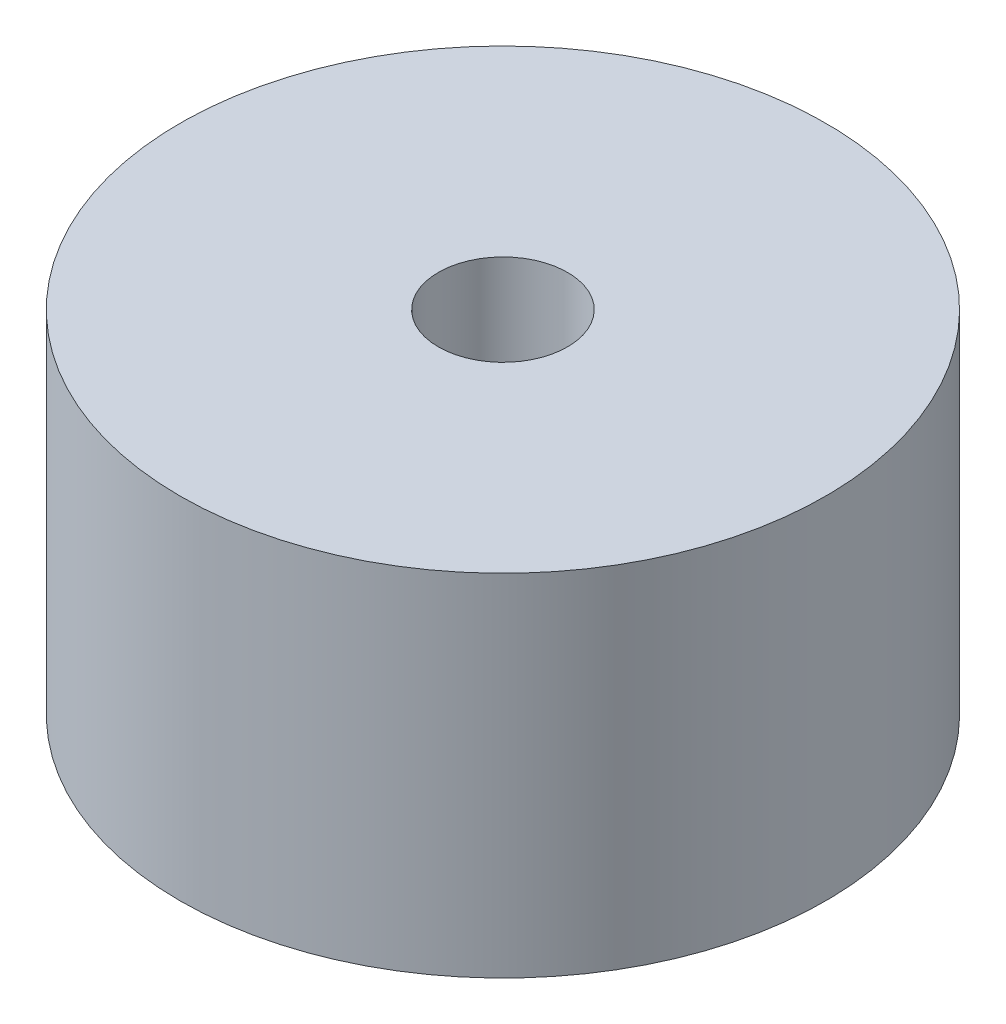
ISO-10303-21;
HEADER;
FILE_DESCRIPTION(('STEP AP214'),'2;1');
FILE_NAME('part.step','',(''),(''),'','','');
FILE_SCHEMA(('AUTOMOTIVE_DESIGN { 1 0 10303 214 1 1 1 1 }'));
ENDSEC;
DATA;
#1=APPLICATION_CONTEXT('core data for automotive mechanical design processes');
#2=APPLICATION_PROTOCOL_DEFINITION('international standard','automotive_design',2000,#1);
#3=PRODUCT_CONTEXT('',#1,'mechanical');
#4=PRODUCT('Part','Part','',(#3));
#5=PRODUCT_RELATED_PRODUCT_CATEGORY('part','',(#4));
#6=PRODUCT_DEFINITION_FORMATION('','',#4);
#7=PRODUCT_DEFINITION_CONTEXT('part definition',#1,'design');
#8=PRODUCT_DEFINITION('design','',#6,#7);
#9=PRODUCT_DEFINITION_SHAPE('','',#8);
#10=(LENGTH_UNIT() NAMED_UNIT(*) SI_UNIT(.MILLI.,.METRE.));
#11=(NAMED_UNIT(*) PLANE_ANGLE_UNIT() SI_UNIT($,.RADIAN.));
#12=(NAMED_UNIT(*) SI_UNIT($,.STERADIAN.) SOLID_ANGLE_UNIT());
#13=UNCERTAINTY_MEASURE_WITH_UNIT(LENGTH_MEASURE(1.E-05),#10,'distance_accuracy_value','');
#14=(GEOMETRIC_REPRESENTATION_CONTEXT(3) GLOBAL_UNCERTAINTY_ASSIGNED_CONTEXT((#13)) GLOBAL_UNIT_ASSIGNED_CONTEXT((#10,
#11,#12)) REPRESENTATION_CONTEXT('',''));
#15=CARTESIAN_POINT('',(0.,0.,0.));
#16=DIRECTION('',(0.,0.,1.));
#17=DIRECTION('',(1.,0.,0.));
#18=AXIS2_PLACEMENT_3D('',#15,#16,#17);
#19=CARTESIAN_POINT('',(35.,30.3265388714364,0.));
#20=DIRECTION('',(0.,-1.,0.));
#21=DIRECTION('',(0.,0.,-1.));
#22=AXIS2_PLACEMENT_3D('',#19,#20,#21);
#23=PLANE('',#22);
#24=CARTESIAN_POINT('',(0.,30.3265388714364,0.));
#25=DIRECTION('',(0.,1.,0.));
#26=DIRECTION('',(0.,0.,1.));
#27=AXIS2_PLACEMENT_3D('',#24,#25,#26);
#28=CIRCLE('',#27,7.);
#29=CARTESIAN_POINT('',(0.,30.3265388714364,7.));
#30=VERTEX_POINT('',#29);
#31=EDGE_CURVE('E10',#30,#30,#28,.T.);
#32=ORIENTED_EDGE('',*,*,#31,.F.);
#33=EDGE_LOOP('',(#32));
#34=FACE_BOUND('',#33,.T.);
#35=CARTESIAN_POINT('',(0.,30.3265388714364,0.));
#36=DIRECTION('',(0.,1.,0.));
#37=DIRECTION('',(0.,0.,1.));
#38=AXIS2_PLACEMENT_3D('',#35,#36,#37);
#39=CIRCLE('',#38,35.);
#40=CARTESIAN_POINT('',(0.,30.3265388714364,35.));
#41=VERTEX_POINT('',#40);
#42=EDGE_CURVE('E64',#41,#41,#39,.T.);
#43=ORIENTED_EDGE('',*,*,#42,.T.);
#44=EDGE_LOOP('',(#43));
#45=FACE_BOUND('',#44,.T.);
#46=ADVANCED_FACE('F41',(#34,#45),#23,.F.);
#47=CARTESIAN_POINT('',(0.,50.5680683786507,0.));
#48=DIRECTION('',(0.,1.,0.));
#49=DIRECTION('',(0.,0.,1.));
#50=AXIS2_PLACEMENT_3D('',#47,#48,#49);
#51=CYLINDRICAL_SURFACE('',#50,7.);
#52=CARTESIAN_POINT('',(0.,10.3265388714364,0.));
#53=DIRECTION('',(0.,1.,0.));
#54=DIRECTION('',(0.,0.,1.));
#55=AXIS2_PLACEMENT_3D('',#52,#53,#54);
#56=CIRCLE('',#55,7.);
#57=CARTESIAN_POINT('',(0.,10.3265388714364,7.));
#58=VERTEX_POINT('',#57);
#59=EDGE_CURVE('E48',#58,#58,#56,.T.);
#60=ORIENTED_EDGE('',*,*,#59,.F.);
#61=EDGE_LOOP('',(#60));
#62=FACE_BOUND('',#61,.T.);
#63=ORIENTED_EDGE('',*,*,#31,.T.);
#64=EDGE_LOOP('',(#63));
#65=FACE_BOUND('',#64,.T.);
#66=ADVANCED_FACE('F84',(#62,#65),#51,.F.);
#67=CARTESIAN_POINT('',(0.,10.3265388714364,0.));
#68=DIRECTION('',(0.,-1.,0.));
#69=DIRECTION('',(0.,0.,-1.));
#70=AXIS2_PLACEMENT_3D('',#67,#68,#69);
#71=CONICAL_SURFACE('',#70,7.,0.785398163397449);
#72=CARTESIAN_POINT('',(0.,-7.67346112856356,0.));
#73=DIRECTION('',(0.,1.,0.));
#74=DIRECTION('',(0.,0.,1.));
#75=AXIS2_PLACEMENT_3D('',#72,#73,#74);
#76=CIRCLE('',#75,25.);
#77=CARTESIAN_POINT('',(0.,-7.67346112856356,25.));
#78=VERTEX_POINT('',#77);
#79=EDGE_CURVE('E53',#78,#78,#76,.T.);
#80=ORIENTED_EDGE('',*,*,#79,.F.);
#81=EDGE_LOOP('',(#80));
#82=FACE_BOUND('',#81,.T.);
#83=ORIENTED_EDGE('',*,*,#59,.T.);
#84=EDGE_LOOP('',(#83));
#85=FACE_BOUND('',#84,.T.);
#86=ADVANCED_FACE('F79',(#82,#85),#71,.F.);
#87=CARTESIAN_POINT('',(25.,-7.67346112856356,0.));
#88=DIRECTION('',(0.,1.,0.));
#89=DIRECTION('',(0.,0.,1.));
#90=AXIS2_PLACEMENT_3D('',#87,#88,#89);
#91=PLANE('',#90);
#92=CARTESIAN_POINT('',(0.,-7.67346112856356,0.));
#93=DIRECTION('',(0.,1.,0.));
#94=DIRECTION('',(0.,0.,1.));
#95=AXIS2_PLACEMENT_3D('',#92,#93,#94);
#96=CIRCLE('',#95,35.);
#97=CARTESIAN_POINT('',(0.,-7.67346112856356,35.));
#98=VERTEX_POINT('',#97);
#99=EDGE_CURVE('E58',#98,#98,#96,.T.);
#100=ORIENTED_EDGE('',*,*,#99,.F.);
#101=EDGE_LOOP('',(#100));
#102=FACE_BOUND('',#101,.T.);
#103=ORIENTED_EDGE('',*,*,#79,.T.);
#104=EDGE_LOOP('',(#103));
#105=FACE_BOUND('',#104,.T.);
#106=ADVANCED_FACE('F73',(#102,#105),#91,.F.);
#107=CARTESIAN_POINT('',(0.,50.5680683786507,0.));
#108=DIRECTION('',(0.,1.,0.));
#109=DIRECTION('',(0.,0.,1.));
#110=AXIS2_PLACEMENT_3D('',#107,#108,#109);
#111=CYLINDRICAL_SURFACE('',#110,35.);
#112=ORIENTED_EDGE('',*,*,#42,.F.);
#113=EDGE_LOOP('',(#112));
#114=FACE_BOUND('',#113,.T.);
#115=ORIENTED_EDGE('',*,*,#99,.T.);
#116=EDGE_LOOP('',(#115));
#117=FACE_BOUND('',#116,.T.);
#118=ADVANCED_FACE('F70',(#114,#117),#111,.T.);
#119=CLOSED_SHELL('',(#46,#66,#86,#106,#118));
#120=MANIFOLD_SOLID_BREP('B2',#119);
#121=ADVANCED_BREP_SHAPE_REPRESENTATION('',(#18,#120),#14);
#122=SHAPE_DEFINITION_REPRESENTATION(#9,#121);
ENDSEC;
END-ISO-10303-21;
